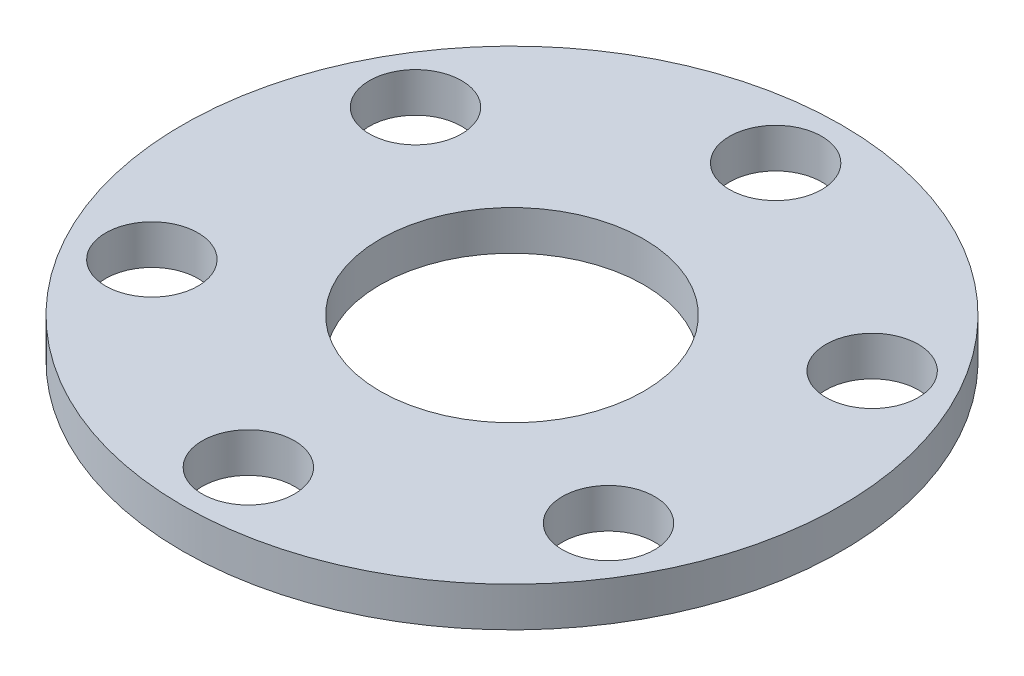
ISO-10303-21;
HEADER;
FILE_DESCRIPTION(('STEP AP214'),'2;1');
FILE_NAME('part.step','',(''),(''),'','','');
FILE_SCHEMA(('AUTOMOTIVE_DESIGN { 1 0 10303 214 1 1 1 1 }'));
ENDSEC;
DATA;
#1=APPLICATION_CONTEXT('core data for automotive mechanical design processes');
#2=APPLICATION_PROTOCOL_DEFINITION('international standard','automotive_design',2000,#1);
#3=PRODUCT_CONTEXT('',#1,'mechanical');
#4=PRODUCT('Part','Part','',(#3));
#5=PRODUCT_RELATED_PRODUCT_CATEGORY('part','',(#4));
#6=PRODUCT_DEFINITION_FORMATION('','',#4);
#7=PRODUCT_DEFINITION_CONTEXT('part definition',#1,'design');
#8=PRODUCT_DEFINITION('design','',#6,#7);
#9=PRODUCT_DEFINITION_SHAPE('','',#8);
#10=(LENGTH_UNIT() NAMED_UNIT(*) SI_UNIT(.MILLI.,.METRE.));
#11=(NAMED_UNIT(*) PLANE_ANGLE_UNIT() SI_UNIT($,.RADIAN.));
#12=(NAMED_UNIT(*) SI_UNIT($,.STERADIAN.) SOLID_ANGLE_UNIT());
#13=UNCERTAINTY_MEASURE_WITH_UNIT(LENGTH_MEASURE(1.E-05),#10,'distance_accuracy_value','');
#14=(GEOMETRIC_REPRESENTATION_CONTEXT(3) GLOBAL_UNCERTAINTY_ASSIGNED_CONTEXT((#13)) GLOBAL_UNIT_ASSIGNED_CONTEXT((#10,
#11,#12)) REPRESENTATION_CONTEXT('',''));
#15=CARTESIAN_POINT('',(0.,0.,0.));
#16=DIRECTION('',(0.,0.,1.));
#17=DIRECTION('',(1.,0.,0.));
#18=AXIS2_PLACEMENT_3D('',#15,#16,#17);
#19=CARTESIAN_POINT('',(0.,1.5,0.));
#20=DIRECTION('',(0.,1.,0.));
#21=DIRECTION('',(0.,0.,1.));
#22=AXIS2_PLACEMENT_3D('',#19,#20,#21);
#23=PLANE('',#22);
#24=CARTESIAN_POINT('',(8.66025403784433,1.5,-5.0000000000001));
#25=DIRECTION('',(0.,1.,0.));
#26=DIRECTION('',(-0.866025403784433,0.,0.50000000000001));
#27=AXIS2_PLACEMENT_3D('',#24,#25,#26);
#28=CIRCLE('',#27,1.75);
#29=CARTESIAN_POINT('',(7.14470958122157,1.5,-4.12500000000008));
#30=VERTEX_POINT('',#29);
#31=EDGE_CURVE('E73',#30,#30,#28,.T.);
#32=ORIENTED_EDGE('',*,*,#31,.F.);
#33=EDGE_LOOP('',(#32));
#34=FACE_BOUND('',#33,.T.);
#35=CARTESIAN_POINT('',(8.66025403784443,1.5,4.99999999999992));
#36=DIRECTION('',(0.,1.,0.));
#37=DIRECTION('',(-0.866025403784443,0.,-0.499999999999992));
#38=AXIS2_PLACEMENT_3D('',#35,#36,#37);
#39=CIRCLE('',#38,1.75);
#40=CARTESIAN_POINT('',(7.14470958122166,1.5,4.12499999999993));
#41=VERTEX_POINT('',#40);
#42=EDGE_CURVE('E79',#41,#41,#39,.T.);
#43=ORIENTED_EDGE('',*,*,#42,.F.);
#44=EDGE_LOOP('',(#43));
#45=FACE_BOUND('',#44,.T.);
#46=CARTESIAN_POINT('',(0.,1.5,10.));
#47=DIRECTION('',(0.,1.,0.));
#48=DIRECTION('',(0.,0.,-1.));
#49=AXIS2_PLACEMENT_3D('',#46,#47,#48);
#50=CIRCLE('',#49,1.75);
#51=CARTESIAN_POINT('',(0.,1.5,8.25));
#52=VERTEX_POINT('',#51);
#53=EDGE_CURVE('E85',#52,#52,#50,.T.);
#54=ORIENTED_EDGE('',*,*,#53,.F.);
#55=EDGE_LOOP('',(#54));
#56=FACE_BOUND('',#55,.T.);
#57=CARTESIAN_POINT('',(-8.66025403784437,1.5,5.00000000000004));
#58=DIRECTION('',(0.,1.,0.));
#59=DIRECTION('',(0.866025403784436,0.,-0.500000000000004));
#60=AXIS2_PLACEMENT_3D('',#57,#58,#59);
#61=CIRCLE('',#60,1.75);
#62=CARTESIAN_POINT('',(-7.1447095812216,1.5,4.12500000000003));
#63=VERTEX_POINT('',#62);
#64=EDGE_CURVE('E67',#63,#63,#61,.T.);
#65=ORIENTED_EDGE('',*,*,#64,.F.);
#66=EDGE_LOOP('',(#65));
#67=FACE_BOUND('',#66,.T.);
#68=CARTESIAN_POINT('',(-8.6602540378444,1.5,-4.99999999999998));
#69=DIRECTION('',(0.,1.,0.));
#70=DIRECTION('',(0.86602540378444,0.,0.499999999999998));
#71=AXIS2_PLACEMENT_3D('',#68,#69,#70);
#72=CIRCLE('',#71,1.75);
#73=CARTESIAN_POINT('',(-7.14470958122163,1.5,-4.12499999999998));
#74=VERTEX_POINT('',#73);
#75=EDGE_CURVE('E61',#74,#74,#72,.T.);
#76=ORIENTED_EDGE('',*,*,#75,.F.);
#77=EDGE_LOOP('',(#76));
#78=FACE_BOUND('',#77,.T.);
#79=CARTESIAN_POINT('',(0.,1.5,-10.));
#80=DIRECTION('',(0.,1.,0.));
#81=DIRECTION('',(0.,0.,1.));
#82=AXIS2_PLACEMENT_3D('',#79,#80,#81);
#83=CIRCLE('',#82,1.75);
#84=CARTESIAN_POINT('',(0.,1.5,-8.25));
#85=VERTEX_POINT('',#84);
#86=EDGE_CURVE('E55',#85,#85,#83,.T.);
#87=ORIENTED_EDGE('',*,*,#86,.F.);
#88=EDGE_LOOP('',(#87));
#89=FACE_BOUND('',#88,.T.);
#90=CARTESIAN_POINT('',(0.,1.5,0.));
#91=DIRECTION('',(0.,1.,0.));
#92=DIRECTION('',(0.,0.,1.));
#93=AXIS2_PLACEMENT_3D('',#90,#91,#92);
#94=CIRCLE('',#93,12.5);
#95=CARTESIAN_POINT('',(0.,1.5,12.5));
#96=VERTEX_POINT('',#95);
#97=EDGE_CURVE('E10',#96,#96,#94,.T.);
#98=ORIENTED_EDGE('',*,*,#97,.T.);
#99=EDGE_LOOP('',(#98));
#100=FACE_BOUND('',#99,.T.);
#101=CARTESIAN_POINT('',(0.,1.5,0.));
#102=DIRECTION('',(0.,1.,0.));
#103=DIRECTION('',(0.,0.,1.));
#104=AXIS2_PLACEMENT_3D('',#101,#102,#103);
#105=CIRCLE('',#104,5.);
#106=CARTESIAN_POINT('',(0.,1.5,5.));
#107=VERTEX_POINT('',#106);
#108=EDGE_CURVE('E50',#107,#107,#105,.T.);
#109=ORIENTED_EDGE('',*,*,#108,.F.);
#110=EDGE_LOOP('',(#109));
#111=FACE_BOUND('',#110,.T.);
#112=ADVANCED_FACE('F39',(#34,#45,#56,#67,#78,#89,#100,#111),#23,.T.);
#113=CARTESIAN_POINT('',(0.,0.,0.));
#114=DIRECTION('',(0.,1.,0.));
#115=DIRECTION('',(0.,0.,1.));
#116=AXIS2_PLACEMENT_3D('',#113,#114,#115);
#117=PLANE('',#116);
#118=CARTESIAN_POINT('',(8.66025403784433,0.,-5.0000000000001));
#119=DIRECTION('',(0.,1.,0.));
#120=DIRECTION('',(-0.866025403784433,0.,0.50000000000001));
#121=AXIS2_PLACEMENT_3D('',#118,#119,#120);
#122=CIRCLE('',#121,1.75);
#123=CARTESIAN_POINT('',(7.14470958122157,0.,-4.12500000000008));
#124=VERTEX_POINT('',#123);
#125=EDGE_CURVE('E70',#124,#124,#122,.T.);
#126=ORIENTED_EDGE('',*,*,#125,.T.);
#127=EDGE_LOOP('',(#126));
#128=FACE_BOUND('',#127,.T.);
#129=CARTESIAN_POINT('',(8.66025403784443,0.,4.99999999999992));
#130=DIRECTION('',(0.,1.,0.));
#131=DIRECTION('',(-0.866025403784443,0.,-0.499999999999992));
#132=AXIS2_PLACEMENT_3D('',#129,#130,#131);
#133=CIRCLE('',#132,1.75);
#134=CARTESIAN_POINT('',(7.14470958122166,0.,4.12499999999993));
#135=VERTEX_POINT('',#134);
#136=EDGE_CURVE('E76',#135,#135,#133,.T.);
#137=ORIENTED_EDGE('',*,*,#136,.T.);
#138=EDGE_LOOP('',(#137));
#139=FACE_BOUND('',#138,.T.);
#140=CARTESIAN_POINT('',(0.,0.,10.));
#141=DIRECTION('',(0.,1.,0.));
#142=DIRECTION('',(0.,0.,-1.));
#143=AXIS2_PLACEMENT_3D('',#140,#141,#142);
#144=CIRCLE('',#143,1.75);
#145=CARTESIAN_POINT('',(0.,0.,8.25));
#146=VERTEX_POINT('',#145);
#147=EDGE_CURVE('E82',#146,#146,#144,.T.);
#148=ORIENTED_EDGE('',*,*,#147,.T.);
#149=EDGE_LOOP('',(#148));
#150=FACE_BOUND('',#149,.T.);
#151=CARTESIAN_POINT('',(-8.66025403784437,0.,5.00000000000004));
#152=DIRECTION('',(0.,1.,0.));
#153=DIRECTION('',(0.866025403784436,0.,-0.500000000000004));
#154=AXIS2_PLACEMENT_3D('',#151,#152,#153);
#155=CIRCLE('',#154,1.75);
#156=CARTESIAN_POINT('',(-7.1447095812216,0.,4.12500000000003));
#157=VERTEX_POINT('',#156);
#158=EDGE_CURVE('E88',#157,#157,#155,.T.);
#159=ORIENTED_EDGE('',*,*,#158,.T.);
#160=EDGE_LOOP('',(#159));
#161=FACE_BOUND('',#160,.T.);
#162=CARTESIAN_POINT('',(-8.6602540378444,0.,-4.99999999999998));
#163=DIRECTION('',(0.,1.,0.));
#164=DIRECTION('',(0.86602540378444,0.,0.499999999999998));
#165=AXIS2_PLACEMENT_3D('',#162,#163,#164);
#166=CIRCLE('',#165,1.75);
#167=CARTESIAN_POINT('',(-7.14470958122163,0.,-4.12499999999998));
#168=VERTEX_POINT('',#167);
#169=EDGE_CURVE('E64',#168,#168,#166,.T.);
#170=ORIENTED_EDGE('',*,*,#169,.T.);
#171=EDGE_LOOP('',(#170));
#172=FACE_BOUND('',#171,.T.);
#173=CARTESIAN_POINT('',(0.,0.,-10.));
#174=DIRECTION('',(0.,1.,0.));
#175=DIRECTION('',(0.,0.,1.));
#176=AXIS2_PLACEMENT_3D('',#173,#174,#175);
#177=CIRCLE('',#176,1.75);
#178=CARTESIAN_POINT('',(0.,0.,-8.25));
#179=VERTEX_POINT('',#178);
#180=EDGE_CURVE('E58',#179,#179,#177,.T.);
#181=ORIENTED_EDGE('',*,*,#180,.T.);
#182=EDGE_LOOP('',(#181));
#183=FACE_BOUND('',#182,.T.);
#184=CARTESIAN_POINT('',(0.,0.,0.));
#185=DIRECTION('',(0.,1.,0.));
#186=DIRECTION('',(0.,0.,1.));
#187=AXIS2_PLACEMENT_3D('',#184,#185,#186);
#188=CIRCLE('',#187,12.5);
#189=CARTESIAN_POINT('',(0.,0.,12.5));
#190=VERTEX_POINT('',#189);
#191=EDGE_CURVE('E43',#190,#190,#188,.T.);
#192=ORIENTED_EDGE('',*,*,#191,.F.);
#193=EDGE_LOOP('',(#192));
#194=FACE_BOUND('',#193,.T.);
#195=CARTESIAN_POINT('',(0.,0.,0.));
#196=DIRECTION('',(0.,1.,0.));
#197=DIRECTION('',(0.,0.,1.));
#198=AXIS2_PLACEMENT_3D('',#195,#196,#197);
#199=CIRCLE('',#198,5.);
#200=CARTESIAN_POINT('',(0.,0.,5.));
#201=VERTEX_POINT('',#200);
#202=EDGE_CURVE('E52',#201,#201,#199,.T.);
#203=ORIENTED_EDGE('',*,*,#202,.T.);
#204=EDGE_LOOP('',(#203));
#205=FACE_BOUND('',#204,.T.);
#206=ADVANCED_FACE('F99',(#128,#139,#150,#161,#172,#183,#194,#205),#117,.F.);
#207=CARTESIAN_POINT('',(0.,1.5,0.));
#208=DIRECTION('',(0.,-1.,0.));
#209=DIRECTION('',(0.,0.,-1.));
#210=AXIS2_PLACEMENT_3D('',#207,#208,#209);
#211=CYLINDRICAL_SURFACE('',#210,12.5);
#212=ORIENTED_EDGE('',*,*,#97,.F.);
#213=EDGE_LOOP('',(#212));
#214=FACE_BOUND('',#213,.T.);
#215=ORIENTED_EDGE('',*,*,#191,.T.);
#216=EDGE_LOOP('',(#215));
#217=FACE_BOUND('',#216,.T.);
#218=ADVANCED_FACE('F41',(#214,#217),#211,.T.);
#219=CARTESIAN_POINT('',(0.,1.5,0.));
#220=DIRECTION('',(0.,-1.,0.));
#221=DIRECTION('',(0.,0.,-1.));
#222=AXIS2_PLACEMENT_3D('',#219,#220,#221);
#223=CYLINDRICAL_SURFACE('',#222,5.);
#224=ORIENTED_EDGE('',*,*,#108,.T.);
#225=EDGE_LOOP('',(#224));
#226=FACE_BOUND('',#225,.T.);
#227=ORIENTED_EDGE('',*,*,#202,.F.);
#228=EDGE_LOOP('',(#227));
#229=FACE_BOUND('',#228,.T.);
#230=ADVANCED_FACE('F108',(#226,#229),#223,.F.);
#231=CARTESIAN_POINT('',(0.,1.5,-10.));
#232=DIRECTION('',(0.,-1.,0.));
#233=DIRECTION('',(0.,0.,-1.));
#234=AXIS2_PLACEMENT_3D('',#231,#232,#233);
#235=CYLINDRICAL_SURFACE('',#234,1.75);
#236=ORIENTED_EDGE('',*,*,#86,.T.);
#237=EDGE_LOOP('',(#236));
#238=FACE_BOUND('',#237,.T.);
#239=ORIENTED_EDGE('',*,*,#180,.F.);
#240=EDGE_LOOP('',(#239));
#241=FACE_BOUND('',#240,.T.);
#242=ADVANCED_FACE('F111',(#238,#241),#235,.F.);
#243=CARTESIAN_POINT('',(-8.6602540378444,1.5,-4.99999999999998));
#244=DIRECTION('',(0.,-1.,0.));
#245=DIRECTION('',(0.,0.,-1.));
#246=AXIS2_PLACEMENT_3D('',#243,#244,#245);
#247=CYLINDRICAL_SURFACE('',#246,1.75);
#248=ORIENTED_EDGE('',*,*,#75,.T.);
#249=EDGE_LOOP('',(#248));
#250=FACE_BOUND('',#249,.T.);
#251=ORIENTED_EDGE('',*,*,#169,.F.);
#252=EDGE_LOOP('',(#251));
#253=FACE_BOUND('',#252,.T.);
#254=ADVANCED_FACE('F125',(#250,#253),#247,.F.);
#255=CARTESIAN_POINT('',(-8.66025403784437,1.5,5.00000000000004));
#256=DIRECTION('',(0.,-1.,0.));
#257=DIRECTION('',(0.,0.,-1.));
#258=AXIS2_PLACEMENT_3D('',#255,#256,#257);
#259=CYLINDRICAL_SURFACE('',#258,1.75);
#260=ORIENTED_EDGE('',*,*,#64,.T.);
#261=EDGE_LOOP('',(#260));
#262=FACE_BOUND('',#261,.T.);
#263=ORIENTED_EDGE('',*,*,#158,.F.);
#264=EDGE_LOOP('',(#263));
#265=FACE_BOUND('',#264,.T.);
#266=ADVANCED_FACE('F94',(#262,#265),#259,.F.);
#267=CARTESIAN_POINT('',(0.,1.5,10.));
#268=DIRECTION('',(0.,-1.,0.));
#269=DIRECTION('',(0.,0.,-1.));
#270=AXIS2_PLACEMENT_3D('',#267,#268,#269);
#271=CYLINDRICAL_SURFACE('',#270,1.75);
#272=ORIENTED_EDGE('',*,*,#53,.T.);
#273=EDGE_LOOP('',(#272));
#274=FACE_BOUND('',#273,.T.);
#275=ORIENTED_EDGE('',*,*,#147,.F.);
#276=EDGE_LOOP('',(#275));
#277=FACE_BOUND('',#276,.T.);
#278=ADVANCED_FACE('F137',(#274,#277),#271,.F.);
#279=CARTESIAN_POINT('',(8.66025403784443,1.5,4.99999999999992));
#280=DIRECTION('',(0.,-1.,0.));
#281=DIRECTION('',(0.,0.,-1.));
#282=AXIS2_PLACEMENT_3D('',#279,#280,#281);
#283=CYLINDRICAL_SURFACE('',#282,1.75);
#284=ORIENTED_EDGE('',*,*,#42,.T.);
#285=EDGE_LOOP('',(#284));
#286=FACE_BOUND('',#285,.T.);
#287=ORIENTED_EDGE('',*,*,#136,.F.);
#288=EDGE_LOOP('',(#287));
#289=FACE_BOUND('',#288,.T.);
#290=ADVANCED_FACE('F133',(#286,#289),#283,.F.);
#291=CARTESIAN_POINT('',(8.66025403784433,1.5,-5.0000000000001));
#292=DIRECTION('',(0.,-1.,0.));
#293=DIRECTION('',(0.,0.,-1.));
#294=AXIS2_PLACEMENT_3D('',#291,#292,#293);
#295=CYLINDRICAL_SURFACE('',#294,1.75);
#296=ORIENTED_EDGE('',*,*,#31,.T.);
#297=EDGE_LOOP('',(#296));
#298=FACE_BOUND('',#297,.T.);
#299=ORIENTED_EDGE('',*,*,#125,.F.);
#300=EDGE_LOOP('',(#299));
#301=FACE_BOUND('',#300,.T.);
#302=ADVANCED_FACE('F130',(#298,#301),#295,.F.);
#303=CLOSED_SHELL('',(#112,#206,#218,#230,#242,#254,#266,#278,#290,#302));
#304=MANIFOLD_SOLID_BREP('B2',#303);
#305=ADVANCED_BREP_SHAPE_REPRESENTATION('',(#18,#304),#14);
#306=SHAPE_DEFINITION_REPRESENTATION(#9,#305);
ENDSEC;
END-ISO-10303-21;
